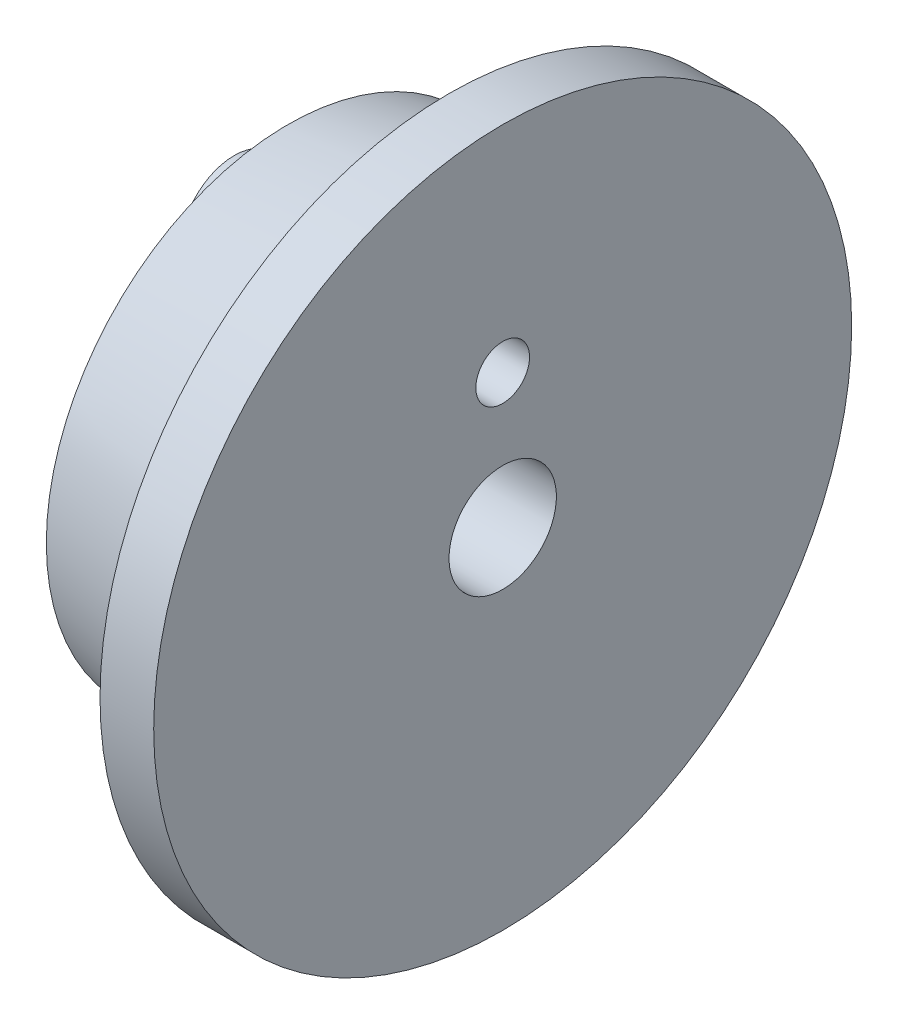
ISO-10303-21;
HEADER;
FILE_DESCRIPTION(('STEP AP214'),'2;1');
FILE_NAME('part.step','',(''),(''),'','','');
FILE_SCHEMA(('AUTOMOTIVE_DESIGN { 1 0 10303 214 1 1 1 1 }'));
ENDSEC;
DATA;
#1=APPLICATION_CONTEXT('core data for automotive mechanical design processes');
#2=APPLICATION_PROTOCOL_DEFINITION('international standard','automotive_design',2000,#1);
#3=PRODUCT_CONTEXT('',#1,'mechanical');
#4=PRODUCT('Part','Part','',(#3));
#5=PRODUCT_RELATED_PRODUCT_CATEGORY('part','',(#4));
#6=PRODUCT_DEFINITION_FORMATION('','',#4);
#7=PRODUCT_DEFINITION_CONTEXT('part definition',#1,'design');
#8=PRODUCT_DEFINITION('design','',#6,#7);
#9=PRODUCT_DEFINITION_SHAPE('','',#8);
#10=(LENGTH_UNIT() NAMED_UNIT(*) SI_UNIT(.MILLI.,.METRE.));
#11=(NAMED_UNIT(*) PLANE_ANGLE_UNIT() SI_UNIT($,.RADIAN.));
#12=(NAMED_UNIT(*) SI_UNIT($,.STERADIAN.) SOLID_ANGLE_UNIT());
#13=UNCERTAINTY_MEASURE_WITH_UNIT(LENGTH_MEASURE(1.E-05),#10,'distance_accuracy_value','');
#14=(GEOMETRIC_REPRESENTATION_CONTEXT(3) GLOBAL_UNCERTAINTY_ASSIGNED_CONTEXT((#13)) GLOBAL_UNIT_ASSIGNED_CONTEXT((#10,
#11,#12)) REPRESENTATION_CONTEXT('',''));
#15=CARTESIAN_POINT('',(0.,0.,0.));
#16=DIRECTION('',(0.,0.,1.));
#17=DIRECTION('',(1.,0.,0.));
#18=AXIS2_PLACEMENT_3D('',#15,#16,#17);
#19=CARTESIAN_POINT('',(-2.07252857729477,1.,0.));
#20=DIRECTION('',(1.,0.,0.));
#21=DIRECTION('',(0.,0.,-1.));
#22=AXIS2_PLACEMENT_3D('',#19,#20,#21);
#23=PLANE('',#22);
#24=CARTESIAN_POINT('',(-2.07252857729477,0.,0.));
#25=DIRECTION('',(-1.,0.,0.));
#26=DIRECTION('',(0.,0.,1.));
#27=AXIS2_PLACEMENT_3D('',#24,#25,#26);
#28=CIRCLE('',#27,4.5);
#29=CARTESIAN_POINT('',(-2.07252857729477,0.,4.5));
#30=VERTEX_POINT('',#29);
#31=EDGE_CURVE('E49',#30,#30,#28,.T.);
#32=ORIENTED_EDGE('',*,*,#31,.T.);
#33=EDGE_LOOP('',(#32));
#34=FACE_BOUND('',#33,.T.);
#35=CARTESIAN_POINT('',(-2.07252857729477,0.,0.));
#36=DIRECTION('',(-1.,0.,0.));
#37=DIRECTION('',(0.,0.,1.));
#38=AXIS2_PLACEMENT_3D('',#35,#36,#37);
#39=CIRCLE('',#38,1.);
#40=CARTESIAN_POINT('',(-2.07252857729477,0.,1.));
#41=VERTEX_POINT('',#40);
#42=EDGE_CURVE('E53',#41,#41,#39,.T.);
#43=ORIENTED_EDGE('',*,*,#42,.F.);
#44=EDGE_LOOP('',(#43));
#45=FACE_BOUND('',#44,.T.);
#46=CARTESIAN_POINT('',(-2.07252857729477,2.5,0.));
#47=DIRECTION('',(1.,0.,0.));
#48=DIRECTION('',(0.,0.,-1.));
#49=AXIS2_PLACEMENT_3D('',#46,#47,#48);
#50=CIRCLE('',#49,1.);
#51=CARTESIAN_POINT('',(-2.07252857729477,2.5,-1.));
#52=VERTEX_POINT('',#51);
#53=EDGE_CURVE('E11',#52,#52,#50,.F.);
#54=ORIENTED_EDGE('',*,*,#53,.F.);
#55=EDGE_LOOP('',(#54));
#56=FACE_BOUND('',#55,.T.);
#57=ADVANCED_FACE('F38',(#34,#45,#56),#23,.F.);
#58=CARTESIAN_POINT('',(0.927471422705225,6.5,0.));
#59=DIRECTION('',(1.,0.,0.));
#60=DIRECTION('',(0.,0.,-1.));
#61=AXIS2_PLACEMENT_3D('',#58,#59,#60);
#62=PLANE('',#61);
#63=CARTESIAN_POINT('',(0.927471422705226,0.,0.));
#64=DIRECTION('',(-1.,0.,0.));
#65=DIRECTION('',(0.,0.,1.));
#66=AXIS2_PLACEMENT_3D('',#63,#64,#65);
#67=CIRCLE('',#66,5.);
#68=CARTESIAN_POINT('',(0.927471422705226,0.,5.));
#69=VERTEX_POINT('',#68);
#70=EDGE_CURVE('E45',#69,#69,#67,.T.);
#71=ORIENTED_EDGE('',*,*,#70,.F.);
#72=EDGE_LOOP('',(#71));
#73=FACE_BOUND('',#72,.T.);
#74=CARTESIAN_POINT('',(0.927471422705224,0.,0.));
#75=DIRECTION('',(-1.,0.,0.));
#76=DIRECTION('',(0.,0.,1.));
#77=AXIS2_PLACEMENT_3D('',#74,#75,#76);
#78=CIRCLE('',#77,6.5);
#79=CARTESIAN_POINT('',(0.927471422705224,0.,6.5));
#80=VERTEX_POINT('',#79);
#81=EDGE_CURVE('E64',#80,#80,#78,.T.);
#82=ORIENTED_EDGE('',*,*,#81,.T.);
#83=EDGE_LOOP('',(#82));
#84=FACE_BOUND('',#83,.T.);
#85=ADVANCED_FACE('F40',(#73,#84),#62,.F.);
#86=CARTESIAN_POINT('',(0.927471422705226,0.,0.));
#87=DIRECTION('',(1.,0.,0.));
#88=DIRECTION('',(0.,0.,-1.));
#89=AXIS2_PLACEMENT_3D('',#86,#87,#88);
#90=CONICAL_SURFACE('',#89,5.,0.165148677414627);
#91=ORIENTED_EDGE('',*,*,#31,.F.);
#92=EDGE_LOOP('',(#91));
#93=FACE_BOUND('',#92,.T.);
#94=ORIENTED_EDGE('',*,*,#70,.T.);
#95=EDGE_LOOP('',(#94));
#96=FACE_BOUND('',#95,.T.);
#97=ADVANCED_FACE('F99',(#93,#96),#90,.T.);
#98=CARTESIAN_POINT('',(-11.4711893790993,0.,0.));
#99=DIRECTION('',(-1.,0.,0.));
#100=DIRECTION('',(0.,0.,1.));
#101=AXIS2_PLACEMENT_3D('',#98,#99,#100);
#102=CYLINDRICAL_SURFACE('',#101,1.);
#103=CARTESIAN_POINT('',(1.92747142270523,0.,0.));
#104=DIRECTION('',(-1.,0.,0.));
#105=DIRECTION('',(0.,0.,1.));
#106=AXIS2_PLACEMENT_3D('',#103,#104,#105);
#107=CIRCLE('',#106,1.);
#108=CARTESIAN_POINT('',(1.92747142270523,0.,1.));
#109=VERTEX_POINT('',#108);
#110=EDGE_CURVE('E58',#109,#109,#107,.T.);
#111=ORIENTED_EDGE('',*,*,#110,.F.);
#112=EDGE_LOOP('',(#111));
#113=FACE_BOUND('',#112,.T.);
#114=ORIENTED_EDGE('',*,*,#42,.T.);
#115=EDGE_LOOP('',(#114));
#116=FACE_BOUND('',#115,.T.);
#117=ADVANCED_FACE('F103',(#113,#116),#102,.F.);
#118=CARTESIAN_POINT('',(1.92747142270523,6.5,0.));
#119=DIRECTION('',(-1.,0.,0.));
#120=DIRECTION('',(0.,0.,1.));
#121=AXIS2_PLACEMENT_3D('',#118,#119,#120);
#122=PLANE('',#121);
#123=CARTESIAN_POINT('',(1.92747142270523,2.5,0.));
#124=DIRECTION('',(1.,0.,0.));
#125=DIRECTION('',(0.,0.,-1.));
#126=AXIS2_PLACEMENT_3D('',#123,#124,#125);
#127=CIRCLE('',#126,0.5);
#128=CARTESIAN_POINT('',(1.92747142270523,2.5,-0.500000000000001));
#129=VERTEX_POINT('',#128);
#130=EDGE_CURVE('E67',#129,#129,#127,.T.);
#131=ORIENTED_EDGE('',*,*,#130,.F.);
#132=EDGE_LOOP('',(#131));
#133=FACE_BOUND('',#132,.T.);
#134=CARTESIAN_POINT('',(1.92747142270523,0.,0.));
#135=DIRECTION('',(-1.,0.,0.));
#136=DIRECTION('',(0.,0.,1.));
#137=AXIS2_PLACEMENT_3D('',#134,#135,#136);
#138=CIRCLE('',#137,6.5);
#139=CARTESIAN_POINT('',(1.92747142270523,0.,6.5));
#140=VERTEX_POINT('',#139);
#141=EDGE_CURVE('E61',#140,#140,#138,.T.);
#142=ORIENTED_EDGE('',*,*,#141,.F.);
#143=EDGE_LOOP('',(#142));
#144=FACE_BOUND('',#143,.T.);
#145=ORIENTED_EDGE('',*,*,#110,.T.);
#146=EDGE_LOOP('',(#145));
#147=FACE_BOUND('',#146,.T.);
#148=ADVANCED_FACE('F110',(#133,#144,#147),#122,.F.);
#149=CARTESIAN_POINT('',(-11.4711893790993,0.,0.));
#150=DIRECTION('',(-1.,0.,0.));
#151=DIRECTION('',(0.,0.,1.));
#152=AXIS2_PLACEMENT_3D('',#149,#150,#151);
#153=CYLINDRICAL_SURFACE('',#152,6.5);
#154=ORIENTED_EDGE('',*,*,#81,.F.);
#155=EDGE_LOOP('',(#154));
#156=FACE_BOUND('',#155,.T.);
#157=ORIENTED_EDGE('',*,*,#141,.T.);
#158=EDGE_LOOP('',(#157));
#159=FACE_BOUND('',#158,.T.);
#160=ADVANCED_FACE('F90',(#156,#159),#153,.T.);
#161=CARTESIAN_POINT('',(-19.4867421396679,2.5,0.));
#162=DIRECTION('',(1.,0.,0.));
#163=DIRECTION('',(0.,0.,-1.));
#164=AXIS2_PLACEMENT_3D('',#161,#162,#163);
#165=CYLINDRICAL_SURFACE('',#164,0.5);
#166=ORIENTED_EDGE('',*,*,#130,.T.);
#167=EDGE_LOOP('',(#166));
#168=FACE_BOUND('',#167,.T.);
#169=CARTESIAN_POINT('',(-3.07252857729477,2.5,0.));
#170=DIRECTION('',(-1.,0.,0.));
#171=DIRECTION('',(0.,0.,1.));
#172=AXIS2_PLACEMENT_3D('',#169,#170,#171);
#173=CIRCLE('',#172,0.5);
#174=CARTESIAN_POINT('',(-3.07252857729477,2.5,0.5));
#175=VERTEX_POINT('',#174);
#176=EDGE_CURVE('E73',#175,#175,#173,.T.);
#177=ORIENTED_EDGE('',*,*,#176,.T.);
#178=EDGE_LOOP('',(#177));
#179=FACE_BOUND('',#178,.T.);
#180=ADVANCED_FACE('F77',(#168,#179),#165,.F.);
#181=CARTESIAN_POINT('',(-3.07252857729477,2.5,0.));
#182=DIRECTION('',(-1.,0.,0.));
#183=DIRECTION('',(0.,0.,1.));
#184=AXIS2_PLACEMENT_3D('',#181,#182,#183);
#185=PLANE('',#184);
#186=CARTESIAN_POINT('',(-3.07252857729477,2.5,0.));
#187=DIRECTION('',(-1.,0.,0.));
#188=DIRECTION('',(0.,0.,1.));
#189=AXIS2_PLACEMENT_3D('',#186,#187,#188);
#190=CIRCLE('',#189,1.);
#191=CARTESIAN_POINT('',(-3.07252857729477,2.5,1.));
#192=VERTEX_POINT('',#191);
#193=EDGE_CURVE('E70',#192,#192,#190,.T.);
#194=ORIENTED_EDGE('',*,*,#193,.T.);
#195=EDGE_LOOP('',(#194));
#196=FACE_BOUND('',#195,.T.);
#197=ORIENTED_EDGE('',*,*,#176,.F.);
#198=EDGE_LOOP('',(#197));
#199=FACE_BOUND('',#198,.T.);
#200=ADVANCED_FACE('F79',(#196,#199),#185,.T.);
#201=CARTESIAN_POINT('',(-3.07252857729477,2.5,0.));
#202=DIRECTION('',(1.,0.,0.));
#203=DIRECTION('',(0.,0.,-1.));
#204=AXIS2_PLACEMENT_3D('',#201,#202,#203);
#205=CYLINDRICAL_SURFACE('',#204,1.);
#206=ORIENTED_EDGE('',*,*,#193,.F.);
#207=EDGE_LOOP('',(#206));
#208=FACE_BOUND('',#207,.T.);
#209=ORIENTED_EDGE('',*,*,#53,.T.);
#210=EDGE_LOOP('',(#209));
#211=FACE_BOUND('',#210,.T.);
#212=ADVANCED_FACE('F81',(#208,#211),#205,.T.);
#213=CLOSED_SHELL('',(#57,#85,#97,#117,#148,#160,#180,#200,#212));
#214=MANIFOLD_SOLID_BREP('B2',#213);
#215=ADVANCED_BREP_SHAPE_REPRESENTATION('',(#18,#214),#14);
#216=SHAPE_DEFINITION_REPRESENTATION(#9,#215);
ENDSEC;
END-ISO-10303-21;
